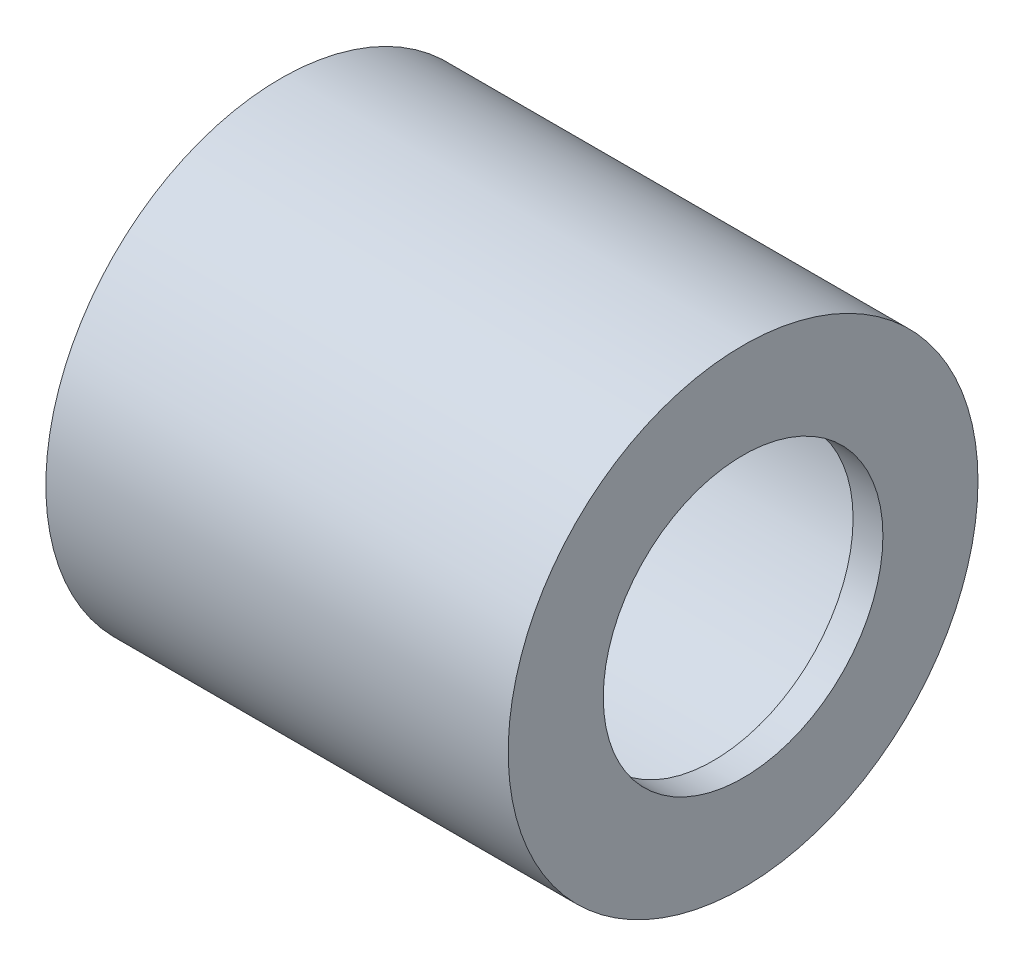
ISO-10303-21;
HEADER;
FILE_DESCRIPTION(('STEP AP214'),'2;1');
FILE_NAME('part.step','',(''),(''),'','','');
FILE_SCHEMA(('AUTOMOTIVE_DESIGN { 1 0 10303 214 1 1 1 1 }'));
ENDSEC;
DATA;
#1=APPLICATION_CONTEXT('core data for automotive mechanical design processes');
#2=APPLICATION_PROTOCOL_DEFINITION('international standard','automotive_design',2000,#1);
#3=PRODUCT_CONTEXT('',#1,'mechanical');
#4=PRODUCT('Part','Part','',(#3));
#5=PRODUCT_RELATED_PRODUCT_CATEGORY('part','',(#4));
#6=PRODUCT_DEFINITION_FORMATION('','',#4);
#7=PRODUCT_DEFINITION_CONTEXT('part definition',#1,'design');
#8=PRODUCT_DEFINITION('design','',#6,#7);
#9=PRODUCT_DEFINITION_SHAPE('','',#8);
#10=(LENGTH_UNIT() NAMED_UNIT(*) SI_UNIT(.MILLI.,.METRE.));
#11=(NAMED_UNIT(*) PLANE_ANGLE_UNIT() SI_UNIT($,.RADIAN.));
#12=(NAMED_UNIT(*) SI_UNIT($,.STERADIAN.) SOLID_ANGLE_UNIT());
#13=UNCERTAINTY_MEASURE_WITH_UNIT(LENGTH_MEASURE(1.E-05),#10,'distance_accuracy_value','');
#14=(GEOMETRIC_REPRESENTATION_CONTEXT(3) GLOBAL_UNCERTAINTY_ASSIGNED_CONTEXT((#13)) GLOBAL_UNIT_ASSIGNED_CONTEXT((#10,
#11,#12)) REPRESENTATION_CONTEXT('',''));
#15=CARTESIAN_POINT('',(0.,0.,0.));
#16=DIRECTION('',(0.,0.,1.));
#17=DIRECTION('',(1.,0.,0.));
#18=AXIS2_PLACEMENT_3D('',#15,#16,#17);
#19=CARTESIAN_POINT('',(7.874,0.,0.));
#20=DIRECTION('',(-1.,0.,0.));
#21=DIRECTION('',(0.,0.,1.));
#22=AXIS2_PLACEMENT_3D('',#19,#20,#21);
#23=CYLINDRICAL_SURFACE('',#22,4.0005);
#24=CARTESIAN_POINT('',(7.874,0.,0.));
#25=DIRECTION('',(1.,0.,0.));
#26=DIRECTION('',(0.,0.,-1.));
#27=AXIS2_PLACEMENT_3D('',#24,#25,#26);
#28=CIRCLE('',#27,4.0005);
#29=CARTESIAN_POINT('',(7.874,0.,-4.0005));
#30=VERTEX_POINT('',#29);
#31=EDGE_CURVE('E10',#30,#30,#28,.T.);
#32=ORIENTED_EDGE('',*,*,#31,.F.);
#33=EDGE_LOOP('',(#32));
#34=FACE_BOUND('',#33,.T.);
#35=CARTESIAN_POINT('',(0.,0.,0.));
#36=DIRECTION('',(1.,0.,0.));
#37=DIRECTION('',(0.,0.,-1.));
#38=AXIS2_PLACEMENT_3D('',#35,#36,#37);
#39=CIRCLE('',#38,4.0005);
#40=CARTESIAN_POINT('',(0.,0.,-4.0005));
#41=VERTEX_POINT('',#40);
#42=EDGE_CURVE('E364',#41,#41,#39,.T.);
#43=ORIENTED_EDGE('',*,*,#42,.T.);
#44=EDGE_LOOP('',(#43));
#45=FACE_BOUND('',#44,.T.);
#46=ADVANCED_FACE('F358',(#34,#45),#23,.T.);
#47=CARTESIAN_POINT('',(7.874,0.,0.));
#48=DIRECTION('',(1.,0.,0.));
#49=DIRECTION('',(0.,0.,-1.));
#50=AXIS2_PLACEMENT_3D('',#47,#48,#49);
#51=PLANE('',#50);
#52=CARTESIAN_POINT('',(7.874,0.,0.));
#53=DIRECTION('',(-1.,0.,0.));
#54=DIRECTION('',(0.,0.,1.));
#55=AXIS2_PLACEMENT_3D('',#52,#53,#54);
#56=CIRCLE('',#55,2.38125);
#57=CARTESIAN_POINT('',(7.874,0.,2.38125));
#58=VERTEX_POINT('',#57);
#59=EDGE_CURVE('E377',#58,#58,#56,.T.);
#60=ORIENTED_EDGE('',*,*,#59,.T.);
#61=EDGE_LOOP('',(#60));
#62=FACE_BOUND('',#61,.T.);
#63=ORIENTED_EDGE('',*,*,#31,.T.);
#64=EDGE_LOOP('',(#63));
#65=FACE_BOUND('',#64,.T.);
#66=ADVANCED_FACE('F401',(#62,#65),#51,.T.);
#67=CARTESIAN_POINT('',(0.,0.,0.));
#68=DIRECTION('',(1.,0.,0.));
#69=DIRECTION('',(0.,0.,-1.));
#70=AXIS2_PLACEMENT_3D('',#67,#68,#69);
#71=PLANE('',#70);
#72=CARTESIAN_POINT('',(0.,0.,0.));
#73=DIRECTION('',(-1.,0.,0.));
#74=DIRECTION('',(0.,0.,1.));
#75=AXIS2_PLACEMENT_3D('',#72,#73,#74);
#76=CIRCLE('',#75,3.603625);
#77=CARTESIAN_POINT('',(0.,0.,3.603625));
#78=VERTEX_POINT('',#77);
#79=EDGE_CURVE('E372',#78,#78,#76,.T.);
#80=ORIENTED_EDGE('',*,*,#79,.F.);
#81=EDGE_LOOP('',(#80));
#82=FACE_BOUND('',#81,.T.);
#83=ORIENTED_EDGE('',*,*,#42,.F.);
#84=EDGE_LOOP('',(#83));
#85=FACE_BOUND('',#84,.T.);
#86=ADVANCED_FACE('F395',(#82,#85),#71,.F.);
#87=CARTESIAN_POINT('',(7.366,0.,0.));
#88=DIRECTION('',(-1.,0.,0.));
#89=DIRECTION('',(0.,0.,1.));
#90=AXIS2_PLACEMENT_3D('',#87,#88,#89);
#91=CYLINDRICAL_SURFACE('',#90,3.603625);
#92=CARTESIAN_POINT('',(7.366,0.,0.));
#93=DIRECTION('',(-1.,0.,0.));
#94=DIRECTION('',(0.,0.,1.));
#95=AXIS2_PLACEMENT_3D('',#92,#93,#94);
#96=CIRCLE('',#95,3.603625);
#97=CARTESIAN_POINT('',(7.366,0.,3.603625));
#98=VERTEX_POINT('',#97);
#99=EDGE_CURVE('E368',#98,#98,#96,.T.);
#100=ORIENTED_EDGE('',*,*,#99,.F.);
#101=EDGE_LOOP('',(#100));
#102=FACE_BOUND('',#101,.T.);
#103=ORIENTED_EDGE('',*,*,#79,.T.);
#104=EDGE_LOOP('',(#103));
#105=FACE_BOUND('',#104,.T.);
#106=ADVANCED_FACE('F389',(#102,#105),#91,.F.);
#107=CARTESIAN_POINT('',(7.366,0.,0.));
#108=DIRECTION('',(-1.,0.,0.));
#109=DIRECTION('',(0.,0.,1.));
#110=AXIS2_PLACEMENT_3D('',#107,#108,#109);
#111=PLANE('',#110);
#112=CARTESIAN_POINT('',(7.366,0.,0.));
#113=DIRECTION('',(-1.,0.,0.));
#114=DIRECTION('',(0.,0.,1.));
#115=AXIS2_PLACEMENT_3D('',#112,#113,#114);
#116=CIRCLE('',#115,2.38125);
#117=CARTESIAN_POINT('',(7.366,0.,2.38125));
#118=VERTEX_POINT('',#117);
#119=EDGE_CURVE('E380',#118,#118,#116,.T.);
#120=ORIENTED_EDGE('',*,*,#119,.F.);
#121=EDGE_LOOP('',(#120));
#122=FACE_BOUND('',#121,.T.);
#123=ORIENTED_EDGE('',*,*,#99,.T.);
#124=EDGE_LOOP('',(#123));
#125=FACE_BOUND('',#124,.T.);
#126=ADVANCED_FACE('F386',(#122,#125),#111,.T.);
#127=CARTESIAN_POINT('',(7.874,0.,0.));
#128=DIRECTION('',(-1.,0.,0.));
#129=DIRECTION('',(0.,0.,1.));
#130=AXIS2_PLACEMENT_3D('',#127,#128,#129);
#131=CYLINDRICAL_SURFACE('',#130,2.38125);
#132=ORIENTED_EDGE('',*,*,#59,.F.);
#133=EDGE_LOOP('',(#132));
#134=FACE_BOUND('',#133,.T.);
#135=ORIENTED_EDGE('',*,*,#119,.T.);
#136=EDGE_LOOP('',(#135));
#137=FACE_BOUND('',#136,.T.);
#138=ADVANCED_FACE('F384',(#134,#137),#131,.F.);
#139=CLOSED_SHELL('',(#46,#66,#86,#106,#126,#138));
#140=MANIFOLD_SOLID_BREP('B2',#139);
#141=ADVANCED_BREP_SHAPE_REPRESENTATION('',(#18,#140),#14);
#142=SHAPE_DEFINITION_REPRESENTATION(#9,#141);
ENDSEC;
END-ISO-10303-21;
